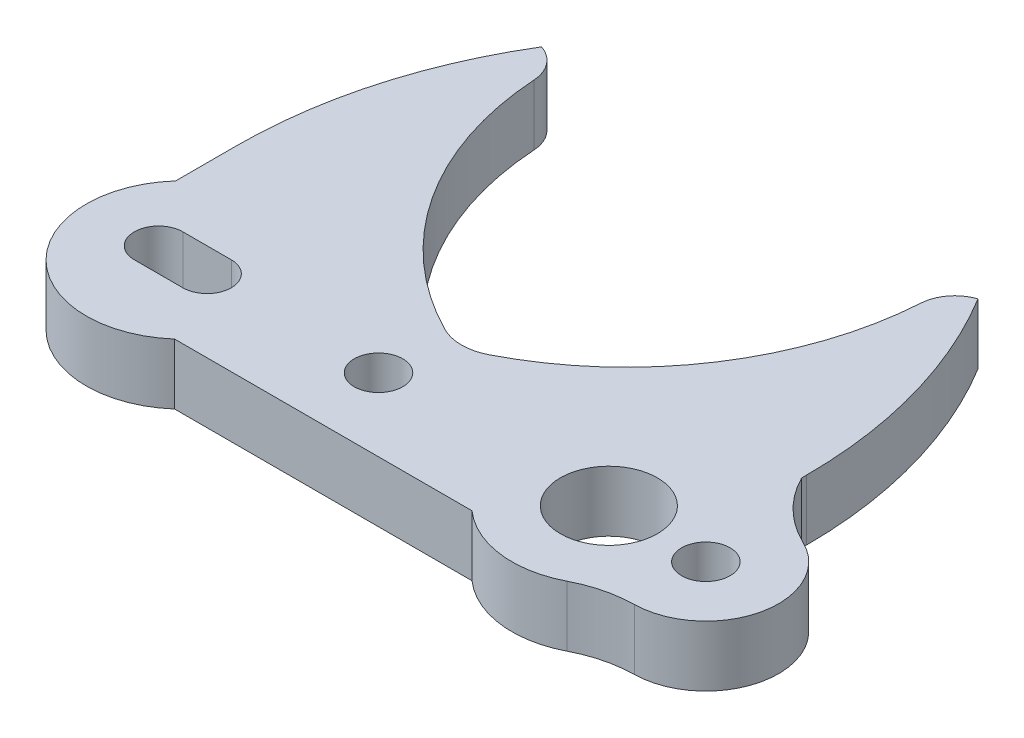
ISO-10303-21;
HEADER;
FILE_DESCRIPTION(('STEP AP214'),'2;1');
FILE_NAME('part.step','',(''),(''),'','','');
FILE_SCHEMA(('AUTOMOTIVE_DESIGN { 1 0 10303 214 1 1 1 1 }'));
ENDSEC;
DATA;
#1=APPLICATION_CONTEXT('core data for automotive mechanical design processes');
#2=APPLICATION_PROTOCOL_DEFINITION('international standard','automotive_design',2000,#1);
#3=PRODUCT_CONTEXT('',#1,'mechanical');
#4=PRODUCT('Part','Part','',(#3));
#5=PRODUCT_RELATED_PRODUCT_CATEGORY('part','',(#4));
#6=PRODUCT_DEFINITION_FORMATION('','',#4);
#7=PRODUCT_DEFINITION_CONTEXT('part definition',#1,'design');
#8=PRODUCT_DEFINITION('design','',#6,#7);
#9=PRODUCT_DEFINITION_SHAPE('','',#8);
#10=(LENGTH_UNIT() NAMED_UNIT(*) SI_UNIT(.MILLI.,.METRE.));
#11=(NAMED_UNIT(*) PLANE_ANGLE_UNIT() SI_UNIT($,.RADIAN.));
#12=(NAMED_UNIT(*) SI_UNIT($,.STERADIAN.) SOLID_ANGLE_UNIT());
#13=UNCERTAINTY_MEASURE_WITH_UNIT(LENGTH_MEASURE(1.E-05),#10,'distance_accuracy_value','');
#14=(GEOMETRIC_REPRESENTATION_CONTEXT(3) GLOBAL_UNCERTAINTY_ASSIGNED_CONTEXT((#13)) GLOBAL_UNIT_ASSIGNED_CONTEXT((#10,
#11,#12)) REPRESENTATION_CONTEXT('',''));
#15=CARTESIAN_POINT('',(0.,0.,0.));
#16=DIRECTION('',(0.,0.,1.));
#17=DIRECTION('',(1.,0.,0.));
#18=AXIS2_PLACEMENT_3D('',#15,#16,#17);
#19=CARTESIAN_POINT('',(32.4452024296811,5.,-18.3840550880154));
#20=DIRECTION('',(0.,-1.,0.));
#21=DIRECTION('',(0.,0.,-1.));
#22=AXIS2_PLACEMENT_3D('',#19,#20,#21);
#23=PLANE('',#22);
#24=CARTESIAN_POINT('',(-1.445,5.,-3.94365653125741));
#25=DIRECTION('',(0.,1.,0.));
#26=DIRECTION('',(0.,0.,1.));
#27=AXIS2_PLACEMENT_3D('',#24,#25,#26);
#28=CIRCLE('',#27,2.);
#29=CARTESIAN_POINT('',(-1.445,5.,-1.94365653125741));
#30=VERTEX_POINT('',#29);
#31=EDGE_CURVE('E206',#30,#30,#28,.T.);
#32=ORIENTED_EDGE('',*,*,#31,.F.);
#33=EDGE_LOOP('',(#32));
#34=FACE_BOUND('',#33,.T.);
#35=CARTESIAN_POINT('',(17.555,5.,-3.94365653125741));
#36=DIRECTION('',(0.,1.,0.));
#37=DIRECTION('',(0.,0.,1.));
#38=AXIS2_PLACEMENT_3D('',#35,#36,#37);
#39=CIRCLE('',#38,4.);
#40=CARTESIAN_POINT('',(17.555,5.,0.0563434687425894));
#41=VERTEX_POINT('',#40);
#42=EDGE_CURVE('E212',#41,#41,#39,.T.);
#43=ORIENTED_EDGE('',*,*,#42,.F.);
#44=EDGE_LOOP('',(#43));
#45=FACE_BOUND('',#44,.T.);
#46=CARTESIAN_POINT('',(-14.2977037553402,5.,-14.2803935708244));
#47=DIRECTION('',(0.,1.,0.));
#48=DIRECTION('',(0.,0.,1.));
#49=AXIS2_PLACEMENT_3D('',#46,#47,#48);
#50=CIRCLE('',#49,37.8125055784307);
#51=CARTESIAN_POINT('',(23.5148018230905,5.,-14.2803935708245));
#52=VERTEX_POINT('',#51);
#53=CARTESIAN_POINT('',(18.,5.,-33.9436565312574));
#54=VERTEX_POINT('',#53);
#55=EDGE_CURVE('E224',#52,#54,#50,.T.);
#56=ORIENTED_EDGE('',*,*,#55,.T.);
#57=CARTESIAN_POINT('',(18.9410211603675,5.,-31.0950640409667));
#58=DIRECTION('',(0.,-1.,0.));
#59=DIRECTION('',(0.,0.,-1.));
#60=AXIS2_PLACEMENT_3D('',#57,#58,#59);
#61=CIRCLE('',#60,3.);
#62=CARTESIAN_POINT('',(15.9471224196398,5.,-31.2862977468588));
#63=VERTEX_POINT('',#62);
#64=EDGE_CURVE('E11',#54,#63,#61,.F.);
#65=ORIENTED_EDGE('',*,*,#64,.T.);
#66=CARTESIAN_POINT('',(-10.,5.,-32.9436565312574));
#67=DIRECTION('',(0.,-1.,0.));
#68=DIRECTION('',(0.,0.,-1.));
#69=AXIS2_PLACEMENT_3D('',#66,#67,#68);
#70=CIRCLE('',#69,26.);
#71=CARTESIAN_POINT('',(1.81818181818182,5.,-9.784844417671));
#72=VERTEX_POINT('',#71);
#73=EDGE_CURVE('E226',#63,#72,#70,.T.);
#74=ORIENTED_EDGE('',*,*,#73,.T.);
#75=CARTESIAN_POINT('',(0.,5.,-13.347738588992));
#76=DIRECTION('',(0.,-1.,0.));
#77=DIRECTION('',(0.,0.,-1.));
#78=AXIS2_PLACEMENT_3D('',#75,#76,#77);
#79=CIRCLE('',#78,4.);
#80=CARTESIAN_POINT('',(-1.81818181818182,5.,-9.784844417671));
#81=VERTEX_POINT('',#80);
#82=EDGE_CURVE('E311',#72,#81,#79,.T.);
#83=ORIENTED_EDGE('',*,*,#82,.T.);
#84=CARTESIAN_POINT('',(10.,5.,-32.9436565312574));
#85=DIRECTION('',(0.,-1.,0.));
#86=DIRECTION('',(0.,0.,1.));
#87=AXIS2_PLACEMENT_3D('',#84,#85,#86);
#88=CIRCLE('',#87,26.);
#89=CARTESIAN_POINT('',(-15.9471224196398,5.,-31.2862977468588));
#90=VERTEX_POINT('',#89);
#91=EDGE_CURVE('E228',#81,#90,#88,.T.);
#92=ORIENTED_EDGE('',*,*,#91,.T.);
#93=CARTESIAN_POINT('',(-18.9410211603675,5.,-31.0950640409667));
#94=DIRECTION('',(0.,-1.,0.));
#95=DIRECTION('',(0.,0.,-1.));
#96=AXIS2_PLACEMENT_3D('',#93,#94,#95);
#97=CIRCLE('',#96,3.);
#98=CARTESIAN_POINT('',(-18.,5.,-33.9436565312574));
#99=VERTEX_POINT('',#98);
#100=EDGE_CURVE('E317',#90,#99,#97,.F.);
#101=ORIENTED_EDGE('',*,*,#100,.T.);
#102=CARTESIAN_POINT('',(14.2977037553402,5.,-14.2803935708244));
#103=DIRECTION('',(0.,1.,0.));
#104=DIRECTION('',(0.,0.,-1.));
#105=AXIS2_PLACEMENT_3D('',#102,#103,#104);
#106=CIRCLE('',#105,37.8125055784307);
#107=CARTESIAN_POINT('',(-23.5148018230905,5.,-14.2803935708245));
#108=VERTEX_POINT('',#107);
#109=EDGE_CURVE('E231',#99,#108,#106,.T.);
#110=ORIENTED_EDGE('',*,*,#109,.T.);
#111=DIRECTION('',(0.,0.,1.));
#112=VECTOR('',#111,1.);
#113=CARTESIAN_POINT('',(-23.5148018230905,5.,-9.28039357082448));
#114=LINE('',#113,#112);
#115=CARTESIAN_POINT('',(-23.5148018230905,5.,-9.28039357082448));
#116=VERTEX_POINT('',#115);
#117=EDGE_CURVE('E233',#108,#116,#114,.T.);
#118=ORIENTED_EDGE('',*,*,#117,.T.);
#119=CARTESIAN_POINT('',(-17.555,5.,-3.94365653125742));
#120=DIRECTION('',(0.,1.,0.));
#121=DIRECTION('',(0.,0.,-1.));
#122=AXIS2_PLACEMENT_3D('',#119,#120,#121);
#123=CIRCLE('',#122,8.);
#124=CARTESIAN_POINT('',(-12.2634973778708,5.,2.05634346874259));
#125=VERTEX_POINT('',#124);
#126=EDGE_CURVE('E235',#116,#125,#123,.T.);
#127=ORIENTED_EDGE('',*,*,#126,.T.);
#128=DIRECTION('',(1.,0.,0.));
#129=VECTOR('',#128,1.);
#130=CARTESIAN_POINT('',(-12.2634973778708,5.,2.05634346874259));
#131=LINE('',#130,#129);
#132=CARTESIAN_POINT('',(12.2634973778708,5.,2.05634346874259));
#133=VERTEX_POINT('',#132);
#134=EDGE_CURVE('E237',#125,#133,#131,.T.);
#135=ORIENTED_EDGE('',*,*,#134,.T.);
#136=CARTESIAN_POINT('',(17.555,5.,-3.94365653125741));
#137=DIRECTION('',(0.,1.,0.));
#138=DIRECTION('',(0.,0.,1.));
#139=AXIS2_PLACEMENT_3D('',#136,#137,#138);
#140=CIRCLE('',#139,8.);
#141=CARTESIAN_POINT('',(21.2216666666666,5.,3.16658647130977));
#142=VERTEX_POINT('',#141);
#143=EDGE_CURVE('E239',#133,#142,#140,.T.);
#144=ORIENTED_EDGE('',*,*,#143,.T.);
#145=CARTESIAN_POINT('',(25.805,5.,12.0543902245188));
#146=DIRECTION('',(0.,-1.,0.));
#147=DIRECTION('',(0.,0.,1.));
#148=AXIS2_PLACEMENT_3D('',#145,#146,#147);
#149=CIRCLE('',#148,10.);
#150=CARTESIAN_POINT('',(25.64875,5.,2.05561100215867));
#151=VERTEX_POINT('',#150);
#152=EDGE_CURVE('E241',#142,#151,#149,.T.);
#153=ORIENTED_EDGE('',*,*,#152,.T.);
#154=CARTESIAN_POINT('',(25.555,5.,-3.94365653125741));
#155=DIRECTION('',(0.,1.,0.));
#156=DIRECTION('',(0.,0.,1.));
#157=AXIS2_PLACEMENT_3D('',#154,#155,#156);
#158=CIRCLE('',#157,6.00000000000002);
#159=CARTESIAN_POINT('',(28.1388259111304,5.,-9.35880599004165));
#160=VERTEX_POINT('',#159);
#161=EDGE_CURVE('E243',#151,#160,#158,.T.);
#162=ORIENTED_EDGE('',*,*,#161,.T.);
#163=CARTESIAN_POINT('',(32.4452024296811,5.,-18.3840550880154));
#164=DIRECTION('',(0.,-1.,0.));
#165=DIRECTION('',(0.,0.,-1.));
#166=AXIS2_PLACEMENT_3D('',#163,#164,#165);
#167=CIRCLE('',#166,10.);
#168=CARTESIAN_POINT('',(23.5148018230905,5.,-13.8842834264968));
#169=VERTEX_POINT('',#168);
#170=EDGE_CURVE('E218',#160,#169,#167,.T.);
#171=ORIENTED_EDGE('',*,*,#170,.T.);
#172=DIRECTION('',(0.,0.,-1.));
#173=VECTOR('',#172,1.);
#174=CARTESIAN_POINT('',(23.5148018230905,5.,-13.8842834264968));
#175=LINE('',#174,#173);
#176=EDGE_CURVE('E221',#169,#52,#175,.T.);
#177=ORIENTED_EDGE('',*,*,#176,.T.);
#178=EDGE_LOOP('',(#56,#65,#74,#83,#92,#101,#110,#118,#127,#135,#144,#153,#162,#171,#177));
#179=FACE_BOUND('',#178,.T.);
#180=CARTESIAN_POINT('',(-19.585,5.,-3.94365653125741));
#181=DIRECTION('',(0.,1.,0.));
#182=DIRECTION('',(0.,0.,1.));
#183=AXIS2_PLACEMENT_3D('',#180,#181,#182);
#184=CIRCLE('',#183,2.);
#185=CARTESIAN_POINT('',(-19.585,5.,-5.94365653125741));
#186=VERTEX_POINT('',#185);
#187=CARTESIAN_POINT('',(-19.585,5.,-1.94365653125741));
#188=VERTEX_POINT('',#187);
#189=EDGE_CURVE('E162',#186,#188,#184,.T.);
#190=ORIENTED_EDGE('',*,*,#189,.F.);
#191=DIRECTION('',(-1.,0.,0.));
#192=VECTOR('',#191,1.);
#193=CARTESIAN_POINT('',(-19.585,5.,-5.94365653125741));
#194=LINE('',#193,#192);
#195=CARTESIAN_POINT('',(-15.585,5.,-5.94365653125741));
#196=VERTEX_POINT('',#195);
#197=EDGE_CURVE('E188',#196,#186,#194,.T.);
#198=ORIENTED_EDGE('',*,*,#197,.F.);
#199=CARTESIAN_POINT('',(-15.585,5.,-3.94365653125741));
#200=DIRECTION('',(0.,1.,0.));
#201=DIRECTION('',(0.,0.,1.));
#202=AXIS2_PLACEMENT_3D('',#199,#200,#201);
#203=CIRCLE('',#202,2.);
#204=CARTESIAN_POINT('',(-15.585,5.,-1.94365653125741));
#205=VERTEX_POINT('',#204);
#206=EDGE_CURVE('E186',#205,#196,#203,.T.);
#207=ORIENTED_EDGE('',*,*,#206,.F.);
#208=DIRECTION('',(1.,0.,0.));
#209=VECTOR('',#208,1.);
#210=CARTESIAN_POINT('',(-19.585,5.,-1.94365653125741));
#211=LINE('',#210,#209);
#212=EDGE_CURVE('E172',#188,#205,#211,.T.);
#213=ORIENTED_EDGE('',*,*,#212,.F.);
#214=EDGE_LOOP('',(#190,#198,#207,#213));
#215=FACE_BOUND('',#214,.T.);
#216=CARTESIAN_POINT('',(25.555,5.,-3.94365653125741));
#217=DIRECTION('',(0.,1.,0.));
#218=DIRECTION('',(0.,0.,1.));
#219=AXIS2_PLACEMENT_3D('',#216,#217,#218);
#220=CIRCLE('',#219,2.);
#221=CARTESIAN_POINT('',(25.555,5.,-1.94365653125741));
#222=VERTEX_POINT('',#221);
#223=EDGE_CURVE('E195',#222,#222,#220,.T.);
#224=ORIENTED_EDGE('',*,*,#223,.F.);
#225=EDGE_LOOP('',(#224));
#226=FACE_BOUND('',#225,.T.);
#227=ADVANCED_FACE('F32',(#34,#45,#179,#215,#226),#23,.F.);
#228=CARTESIAN_POINT('',(32.4452024296811,0.,-18.3840550880154));
#229=DIRECTION('',(0.,-1.,0.));
#230=DIRECTION('',(0.,0.,-1.));
#231=AXIS2_PLACEMENT_3D('',#228,#229,#230);
#232=PLANE('',#231);
#233=DIRECTION('',(-1.,0.,0.));
#234=VECTOR('',#233,1.);
#235=CARTESIAN_POINT('',(-19.585,0.,-5.94365653125741));
#236=LINE('',#235,#234);
#237=CARTESIAN_POINT('',(-15.585,0.,-5.94365653125741));
#238=VERTEX_POINT('',#237);
#239=CARTESIAN_POINT('',(-19.585,0.,-5.94365653125741));
#240=VERTEX_POINT('',#239);
#241=EDGE_CURVE('E173',#238,#240,#236,.T.);
#242=ORIENTED_EDGE('',*,*,#241,.T.);
#243=CARTESIAN_POINT('',(-19.585,0.,-3.94365653125741));
#244=DIRECTION('',(0.,1.,0.));
#245=DIRECTION('',(0.,0.,1.));
#246=AXIS2_PLACEMENT_3D('',#243,#244,#245);
#247=CIRCLE('',#246,2.);
#248=CARTESIAN_POINT('',(-19.585,0.,-1.94365653125741));
#249=VERTEX_POINT('',#248);
#250=EDGE_CURVE('E193',#240,#249,#247,.T.);
#251=ORIENTED_EDGE('',*,*,#250,.T.);
#252=DIRECTION('',(1.,0.,0.));
#253=VECTOR('',#252,1.);
#254=CARTESIAN_POINT('',(-19.585,0.,-1.94365653125741));
#255=LINE('',#254,#253);
#256=CARTESIAN_POINT('',(-15.585,0.,-1.94365653125741));
#257=VERTEX_POINT('',#256);
#258=EDGE_CURVE('E179',#249,#257,#255,.T.);
#259=ORIENTED_EDGE('',*,*,#258,.T.);
#260=CARTESIAN_POINT('',(-15.585,0.,-3.94365653125741));
#261=DIRECTION('',(0.,1.,0.));
#262=DIRECTION('',(0.,0.,1.));
#263=AXIS2_PLACEMENT_3D('',#260,#261,#262);
#264=CIRCLE('',#263,2.);
#265=EDGE_CURVE('E197',#257,#238,#264,.T.);
#266=ORIENTED_EDGE('',*,*,#265,.T.);
#267=EDGE_LOOP('',(#242,#251,#259,#266));
#268=FACE_BOUND('',#267,.T.);
#269=CARTESIAN_POINT('',(-1.445,0.,-3.94365653125741));
#270=DIRECTION('',(0.,1.,0.));
#271=DIRECTION('',(0.,0.,1.));
#272=AXIS2_PLACEMENT_3D('',#269,#270,#271);
#273=CIRCLE('',#272,2.);
#274=CARTESIAN_POINT('',(-1.445,0.,-1.94365653125741));
#275=VERTEX_POINT('',#274);
#276=EDGE_CURVE('E180',#275,#275,#273,.T.);
#277=ORIENTED_EDGE('',*,*,#276,.T.);
#278=EDGE_LOOP('',(#277));
#279=FACE_BOUND('',#278,.T.);
#280=CARTESIAN_POINT('',(-10.,0.,-32.9436565312574));
#281=DIRECTION('',(0.,-1.,0.));
#282=DIRECTION('',(0.,0.,-1.));
#283=AXIS2_PLACEMENT_3D('',#280,#281,#282);
#284=CIRCLE('',#283,26.);
#285=CARTESIAN_POINT('',(15.9471224196398,0.,-31.2862977468588));
#286=VERTEX_POINT('',#285);
#287=CARTESIAN_POINT('',(1.81818181818182,0.,-9.784844417671));
#288=VERTEX_POINT('',#287);
#289=EDGE_CURVE('E253',#286,#288,#284,.T.);
#290=ORIENTED_EDGE('',*,*,#289,.F.);
#291=CARTESIAN_POINT('',(18.9410211603675,0.,-31.0950640409667));
#292=DIRECTION('',(0.,-1.,0.));
#293=DIRECTION('',(0.,0.,-1.));
#294=AXIS2_PLACEMENT_3D('',#291,#292,#293);
#295=CIRCLE('',#294,3.);
#296=CARTESIAN_POINT('',(18.,0.,-33.9436565312574));
#297=VERTEX_POINT('',#296);
#298=EDGE_CURVE('E40',#286,#297,#295,.T.);
#299=ORIENTED_EDGE('',*,*,#298,.T.);
#300=CARTESIAN_POINT('',(-14.2977037553402,0.,-14.2803935708244));
#301=DIRECTION('',(0.,1.,0.));
#302=DIRECTION('',(0.,0.,1.));
#303=AXIS2_PLACEMENT_3D('',#300,#301,#302);
#304=CIRCLE('',#303,37.8125055784307);
#305=CARTESIAN_POINT('',(23.5148018230905,0.,-14.2803935708245));
#306=VERTEX_POINT('',#305);
#307=EDGE_CURVE('E250',#306,#297,#304,.T.);
#308=ORIENTED_EDGE('',*,*,#307,.F.);
#309=DIRECTION('',(0.,0.,-1.));
#310=VECTOR('',#309,1.);
#311=CARTESIAN_POINT('',(23.5148018230905,0.,-13.8842834264968));
#312=LINE('',#311,#310);
#313=CARTESIAN_POINT('',(23.5148018230905,0.,-13.8842834264968));
#314=VERTEX_POINT('',#313);
#315=EDGE_CURVE('E248',#314,#306,#312,.T.);
#316=ORIENTED_EDGE('',*,*,#315,.F.);
#317=CARTESIAN_POINT('',(32.4452024296811,0.,-18.3840550880154));
#318=DIRECTION('',(0.,-1.,0.));
#319=DIRECTION('',(0.,0.,-1.));
#320=AXIS2_PLACEMENT_3D('',#317,#318,#319);
#321=CIRCLE('',#320,10.);
#322=CARTESIAN_POINT('',(28.1388259111304,0.,-9.35880599004165));
#323=VERTEX_POINT('',#322);
#324=EDGE_CURVE('E215',#323,#314,#321,.T.);
#325=ORIENTED_EDGE('',*,*,#324,.F.);
#326=CARTESIAN_POINT('',(25.555,0.,-3.94365653125741));
#327=DIRECTION('',(0.,1.,0.));
#328=DIRECTION('',(0.,0.,1.));
#329=AXIS2_PLACEMENT_3D('',#326,#327,#328);
#330=CIRCLE('',#329,6.00000000000002);
#331=CARTESIAN_POINT('',(25.64875,0.,2.05561100215867));
#332=VERTEX_POINT('',#331);
#333=EDGE_CURVE('E222',#332,#323,#330,.T.);
#334=ORIENTED_EDGE('',*,*,#333,.F.);
#335=CARTESIAN_POINT('',(25.805,0.,12.0543902245188));
#336=DIRECTION('',(0.,-1.,0.));
#337=DIRECTION('',(0.,0.,1.));
#338=AXIS2_PLACEMENT_3D('',#335,#336,#337);
#339=CIRCLE('',#338,10.);
#340=CARTESIAN_POINT('',(21.2216666666666,0.,3.16658647130977));
#341=VERTEX_POINT('',#340);
#342=EDGE_CURVE('E268',#341,#332,#339,.T.);
#343=ORIENTED_EDGE('',*,*,#342,.F.);
#344=CARTESIAN_POINT('',(17.555,0.,-3.94365653125741));
#345=DIRECTION('',(0.,1.,0.));
#346=DIRECTION('',(0.,0.,1.));
#347=AXIS2_PLACEMENT_3D('',#344,#345,#346);
#348=CIRCLE('',#347,8.);
#349=CARTESIAN_POINT('',(12.2634973778708,0.,2.05634346874259));
#350=VERTEX_POINT('',#349);
#351=EDGE_CURVE('E266',#350,#341,#348,.T.);
#352=ORIENTED_EDGE('',*,*,#351,.F.);
#353=DIRECTION('',(1.,0.,0.));
#354=VECTOR('',#353,1.);
#355=CARTESIAN_POINT('',(-12.2634973778708,0.,2.05634346874259));
#356=LINE('',#355,#354);
#357=CARTESIAN_POINT('',(-12.2634973778708,0.,2.05634346874259));
#358=VERTEX_POINT('',#357);
#359=EDGE_CURVE('E264',#358,#350,#356,.T.);
#360=ORIENTED_EDGE('',*,*,#359,.F.);
#361=CARTESIAN_POINT('',(-17.555,0.,-3.94365653125742));
#362=DIRECTION('',(0.,1.,0.));
#363=DIRECTION('',(0.,0.,-1.));
#364=AXIS2_PLACEMENT_3D('',#361,#362,#363);
#365=CIRCLE('',#364,8.);
#366=CARTESIAN_POINT('',(-23.5148018230905,0.,-9.28039357082448));
#367=VERTEX_POINT('',#366);
#368=EDGE_CURVE('E262',#367,#358,#365,.T.);
#369=ORIENTED_EDGE('',*,*,#368,.F.);
#370=DIRECTION('',(0.,0.,1.));
#371=VECTOR('',#370,1.);
#372=CARTESIAN_POINT('',(-23.5148018230905,0.,-9.28039357082448));
#373=LINE('',#372,#371);
#374=CARTESIAN_POINT('',(-23.5148018230905,0.,-14.2803935708245));
#375=VERTEX_POINT('',#374);
#376=EDGE_CURVE('E260',#375,#367,#373,.T.);
#377=ORIENTED_EDGE('',*,*,#376,.F.);
#378=CARTESIAN_POINT('',(14.2977037553402,0.,-14.2803935708244));
#379=DIRECTION('',(0.,1.,0.));
#380=DIRECTION('',(0.,0.,-1.));
#381=AXIS2_PLACEMENT_3D('',#378,#379,#380);
#382=CIRCLE('',#381,37.8125055784307);
#383=CARTESIAN_POINT('',(-18.,0.,-33.9436565312574));
#384=VERTEX_POINT('',#383);
#385=EDGE_CURVE('E258',#384,#375,#382,.T.);
#386=ORIENTED_EDGE('',*,*,#385,.F.);
#387=CARTESIAN_POINT('',(-18.9410211603675,0.,-31.0950640409667));
#388=DIRECTION('',(0.,-1.,0.));
#389=DIRECTION('',(0.,0.,-1.));
#390=AXIS2_PLACEMENT_3D('',#387,#388,#389);
#391=CIRCLE('',#390,3.);
#392=CARTESIAN_POINT('',(-15.9471224196398,0.,-31.2862977468588));
#393=VERTEX_POINT('',#392);
#394=EDGE_CURVE('E313',#384,#393,#391,.T.);
#395=ORIENTED_EDGE('',*,*,#394,.T.);
#396=CARTESIAN_POINT('',(10.,0.,-32.9436565312574));
#397=DIRECTION('',(0.,-1.,0.));
#398=DIRECTION('',(0.,0.,1.));
#399=AXIS2_PLACEMENT_3D('',#396,#397,#398);
#400=CIRCLE('',#399,26.);
#401=CARTESIAN_POINT('',(-1.81818181818182,0.,-9.784844417671));
#402=VERTEX_POINT('',#401);
#403=EDGE_CURVE('E255',#402,#393,#400,.T.);
#404=ORIENTED_EDGE('',*,*,#403,.F.);
#405=CARTESIAN_POINT('',(0.,0.,-13.347738588992));
#406=DIRECTION('',(0.,-1.,0.));
#407=DIRECTION('',(0.,0.,-1.));
#408=AXIS2_PLACEMENT_3D('',#405,#406,#407);
#409=CIRCLE('',#408,4.);
#410=EDGE_CURVE('E308',#402,#288,#409,.F.);
#411=ORIENTED_EDGE('',*,*,#410,.T.);
#412=EDGE_LOOP('',(#290,#299,#308,#316,#325,#334,#343,#352,#360,#369,#377,#386,#395,#404,#411));
#413=FACE_BOUND('',#412,.T.);
#414=CARTESIAN_POINT('',(17.555,0.,-3.94365653125741));
#415=DIRECTION('',(0.,1.,0.));
#416=DIRECTION('',(0.,0.,1.));
#417=AXIS2_PLACEMENT_3D('',#414,#415,#416);
#418=CIRCLE('',#417,4.);
#419=CARTESIAN_POINT('',(17.555,0.,0.0563434687425894));
#420=VERTEX_POINT('',#419);
#421=EDGE_CURVE('E209',#420,#420,#418,.T.);
#422=ORIENTED_EDGE('',*,*,#421,.T.);
#423=EDGE_LOOP('',(#422));
#424=FACE_BOUND('',#423,.T.);
#425=CARTESIAN_POINT('',(25.555,0.,-3.94365653125741));
#426=DIRECTION('',(0.,1.,0.));
#427=DIRECTION('',(0.,0.,1.));
#428=AXIS2_PLACEMENT_3D('',#425,#426,#427);
#429=CIRCLE('',#428,2.);
#430=CARTESIAN_POINT('',(25.555,0.,-1.94365653125741));
#431=VERTEX_POINT('',#430);
#432=EDGE_CURVE('E597',#431,#431,#429,.T.);
#433=ORIENTED_EDGE('',*,*,#432,.T.);
#434=EDGE_LOOP('',(#433));
#435=FACE_BOUND('',#434,.T.);
#436=ADVANCED_FACE('F323',(#268,#279,#413,#424,#435),#232,.T.);
#437=CARTESIAN_POINT('',(32.4452024296811,5.,-18.3840550880154));
#438=DIRECTION('',(0.,-1.,0.));
#439=DIRECTION('',(0.,0.,-1.));
#440=AXIS2_PLACEMENT_3D('',#437,#438,#439);
#441=CYLINDRICAL_SURFACE('',#440,10.);
#442=ORIENTED_EDGE('',*,*,#324,.T.);
#443=DIRECTION('',(0.,-1.,0.));
#444=VECTOR('',#443,1.);
#445=CARTESIAN_POINT('',(23.5148018230905,5.,-13.8842834264968));
#446=LINE('',#445,#444);
#447=EDGE_CURVE('E299',#169,#314,#446,.T.);
#448=ORIENTED_EDGE('',*,*,#447,.F.);
#449=ORIENTED_EDGE('',*,*,#170,.F.);
#450=DIRECTION('',(0.,-1.,0.));
#451=VECTOR('',#450,1.);
#452=CARTESIAN_POINT('',(28.1388259111304,5.,-9.35880599004165));
#453=LINE('',#452,#451);
#454=EDGE_CURVE('E245',#160,#323,#453,.T.);
#455=ORIENTED_EDGE('',*,*,#454,.T.);
#456=EDGE_LOOP('',(#442,#448,#449,#455));
#457=FACE_BOUND('',#456,.T.);
#458=ADVANCED_FACE('F385',(#457),#441,.F.);
#459=CARTESIAN_POINT('',(23.5148018230905,5.,-13.8842834264968));
#460=DIRECTION('',(-1.,0.,0.));
#461=DIRECTION('',(0.,0.,1.));
#462=AXIS2_PLACEMENT_3D('',#459,#460,#461);
#463=PLANE('',#462);
#464=ORIENTED_EDGE('',*,*,#315,.T.);
#465=DIRECTION('',(0.,-1.,0.));
#466=VECTOR('',#465,1.);
#467=CARTESIAN_POINT('',(23.5148018230905,5.,-14.2803935708245));
#468=LINE('',#467,#466);
#469=EDGE_CURVE('E296',#52,#306,#468,.T.);
#470=ORIENTED_EDGE('',*,*,#469,.F.);
#471=ORIENTED_EDGE('',*,*,#176,.F.);
#472=ORIENTED_EDGE('',*,*,#447,.T.);
#473=EDGE_LOOP('',(#464,#470,#471,#472));
#474=FACE_BOUND('',#473,.T.);
#475=ADVANCED_FACE('F387',(#474),#463,.F.);
#476=CARTESIAN_POINT('',(-14.2977037553402,5.,-14.2803935708244));
#477=DIRECTION('',(0.,-1.,0.));
#478=DIRECTION('',(0.,0.,-1.));
#479=AXIS2_PLACEMENT_3D('',#476,#477,#478);
#480=CYLINDRICAL_SURFACE('',#479,37.8125055784307);
#481=ORIENTED_EDGE('',*,*,#307,.T.);
#482=DIRECTION('',(0.,-1.,0.));
#483=VECTOR('',#482,1.);
#484=CARTESIAN_POINT('',(18.,5.,-33.9436565312574));
#485=LINE('',#484,#483);
#486=EDGE_CURVE('E294',#54,#297,#485,.T.);
#487=ORIENTED_EDGE('',*,*,#486,.F.);
#488=ORIENTED_EDGE('',*,*,#55,.F.);
#489=ORIENTED_EDGE('',*,*,#469,.T.);
#490=EDGE_LOOP('',(#481,#487,#488,#489));
#491=FACE_BOUND('',#490,.T.);
#492=ADVANCED_FACE('F327',(#491),#480,.T.);
#493=CARTESIAN_POINT('',(-10.,5.,-32.9436565312574));
#494=DIRECTION('',(0.,-1.,0.));
#495=DIRECTION('',(0.,0.,-1.));
#496=AXIS2_PLACEMENT_3D('',#493,#494,#495);
#497=CYLINDRICAL_SURFACE('',#496,26.);
#498=ORIENTED_EDGE('',*,*,#73,.F.);
#499=DIRECTION('',(0.,-1.,0.));
#500=VECTOR('',#499,1.);
#501=CARTESIAN_POINT('',(15.9471224196398,5.,-31.2862977468588));
#502=LINE('',#501,#500);
#503=EDGE_CURVE('E319',#63,#286,#502,.T.);
#504=ORIENTED_EDGE('',*,*,#503,.T.);
#505=ORIENTED_EDGE('',*,*,#289,.T.);
#506=DIRECTION('',(0.,-1.,0.));
#507=VECTOR('',#506,1.);
#508=CARTESIAN_POINT('',(1.81818181818182,5.,-9.784844417671));
#509=LINE('',#508,#507);
#510=EDGE_CURVE('E305',#288,#72,#509,.F.);
#511=ORIENTED_EDGE('',*,*,#510,.T.);
#512=EDGE_LOOP('',(#498,#504,#505,#511));
#513=FACE_BOUND('',#512,.T.);
#514=ADVANCED_FACE('F331',(#513),#497,.F.);
#515=CARTESIAN_POINT('',(10.,5.,-32.9436565312574));
#516=DIRECTION('',(0.,-1.,0.));
#517=DIRECTION('',(0.,0.,-1.));
#518=AXIS2_PLACEMENT_3D('',#515,#516,#517);
#519=CYLINDRICAL_SURFACE('',#518,26.);
#520=ORIENTED_EDGE('',*,*,#403,.T.);
#521=DIRECTION('',(0.,-1.,0.));
#522=VECTOR('',#521,1.);
#523=CARTESIAN_POINT('',(-15.9471224196398,5.,-31.2862977468588));
#524=LINE('',#523,#522);
#525=EDGE_CURVE('E315',#393,#90,#524,.F.);
#526=ORIENTED_EDGE('',*,*,#525,.T.);
#527=ORIENTED_EDGE('',*,*,#91,.F.);
#528=DIRECTION('',(0.,-1.,0.));
#529=VECTOR('',#528,1.);
#530=CARTESIAN_POINT('',(-1.81818181818182,5.,-9.784844417671));
#531=LINE('',#530,#529);
#532=EDGE_CURVE('E302',#81,#402,#531,.T.);
#533=ORIENTED_EDGE('',*,*,#532,.T.);
#534=EDGE_LOOP('',(#520,#526,#527,#533));
#535=FACE_BOUND('',#534,.T.);
#536=ADVANCED_FACE('F339',(#535),#519,.F.);
#537=CARTESIAN_POINT('',(14.2977037553402,5.,-14.2803935708244));
#538=DIRECTION('',(0.,-1.,0.));
#539=DIRECTION('',(0.,0.,-1.));
#540=AXIS2_PLACEMENT_3D('',#537,#538,#539);
#541=CYLINDRICAL_SURFACE('',#540,37.8125055784307);
#542=ORIENTED_EDGE('',*,*,#385,.T.);
#543=DIRECTION('',(0.,-1.,0.));
#544=VECTOR('',#543,1.);
#545=CARTESIAN_POINT('',(-23.5148018230905,5.,-14.2803935708245));
#546=LINE('',#545,#544);
#547=EDGE_CURVE('E288',#108,#375,#546,.T.);
#548=ORIENTED_EDGE('',*,*,#547,.F.);
#549=ORIENTED_EDGE('',*,*,#109,.F.);
#550=DIRECTION('',(0.,-1.,0.));
#551=VECTOR('',#550,1.);
#552=CARTESIAN_POINT('',(-18.,5.,-33.9436565312574));
#553=LINE('',#552,#551);
#554=EDGE_CURVE('E291',#99,#384,#553,.T.);
#555=ORIENTED_EDGE('',*,*,#554,.T.);
#556=EDGE_LOOP('',(#542,#548,#549,#555));
#557=FACE_BOUND('',#556,.T.);
#558=ADVANCED_FACE('F350',(#557),#541,.T.);
#559=CARTESIAN_POINT('',(-23.5148018230905,5.,-9.28039357082448));
#560=DIRECTION('',(1.,0.,0.));
#561=DIRECTION('',(0.,0.,-1.));
#562=AXIS2_PLACEMENT_3D('',#559,#560,#561);
#563=PLANE('',#562);
#564=ORIENTED_EDGE('',*,*,#376,.T.);
#565=DIRECTION('',(0.,-1.,0.));
#566=VECTOR('',#565,1.);
#567=CARTESIAN_POINT('',(-23.5148018230905,5.,-9.28039357082448));
#568=LINE('',#567,#566);
#569=EDGE_CURVE('E285',#116,#367,#568,.T.);
#570=ORIENTED_EDGE('',*,*,#569,.F.);
#571=ORIENTED_EDGE('',*,*,#117,.F.);
#572=ORIENTED_EDGE('',*,*,#547,.T.);
#573=EDGE_LOOP('',(#564,#570,#571,#572));
#574=FACE_BOUND('',#573,.T.);
#575=ADVANCED_FACE('F355',(#574),#563,.F.);
#576=CARTESIAN_POINT('',(-17.555,5.,-3.94365653125742));
#577=DIRECTION('',(0.,-1.,0.));
#578=DIRECTION('',(0.,0.,-1.));
#579=AXIS2_PLACEMENT_3D('',#576,#577,#578);
#580=CYLINDRICAL_SURFACE('',#579,8.);
#581=ORIENTED_EDGE('',*,*,#368,.T.);
#582=DIRECTION('',(0.,-1.,0.));
#583=VECTOR('',#582,1.);
#584=CARTESIAN_POINT('',(-12.2634973778708,5.,2.05634346874259));
#585=LINE('',#584,#583);
#586=EDGE_CURVE('E282',#125,#358,#585,.T.);
#587=ORIENTED_EDGE('',*,*,#586,.F.);
#588=ORIENTED_EDGE('',*,*,#126,.F.);
#589=ORIENTED_EDGE('',*,*,#569,.T.);
#590=EDGE_LOOP('',(#581,#587,#588,#589));
#591=FACE_BOUND('',#590,.T.);
#592=ADVANCED_FACE('F361',(#591),#580,.T.);
#593=CARTESIAN_POINT('',(-12.2634973778708,5.,2.05634346874259));
#594=DIRECTION('',(0.,0.,-1.));
#595=DIRECTION('',(-1.,0.,0.));
#596=AXIS2_PLACEMENT_3D('',#593,#594,#595);
#597=PLANE('',#596);
#598=ORIENTED_EDGE('',*,*,#359,.T.);
#599=DIRECTION('',(0.,-1.,0.));
#600=VECTOR('',#599,1.);
#601=CARTESIAN_POINT('',(12.2634973778708,5.,2.05634346874259));
#602=LINE('',#601,#600);
#603=EDGE_CURVE('E279',#133,#350,#602,.T.);
#604=ORIENTED_EDGE('',*,*,#603,.F.);
#605=ORIENTED_EDGE('',*,*,#134,.F.);
#606=ORIENTED_EDGE('',*,*,#586,.T.);
#607=EDGE_LOOP('',(#598,#604,#605,#606));
#608=FACE_BOUND('',#607,.T.);
#609=ADVANCED_FACE('F365',(#608),#597,.F.);
#610=CARTESIAN_POINT('',(17.555,5.,-3.94365653125741));
#611=DIRECTION('',(0.,-1.,0.));
#612=DIRECTION('',(0.,0.,-1.));
#613=AXIS2_PLACEMENT_3D('',#610,#611,#612);
#614=CYLINDRICAL_SURFACE('',#613,8.);
#615=ORIENTED_EDGE('',*,*,#351,.T.);
#616=DIRECTION('',(0.,-1.,0.));
#617=VECTOR('',#616,1.);
#618=CARTESIAN_POINT('',(21.2216666666666,5.,3.16658647130977));
#619=LINE('',#618,#617);
#620=EDGE_CURVE('E276',#142,#341,#619,.T.);
#621=ORIENTED_EDGE('',*,*,#620,.F.);
#622=ORIENTED_EDGE('',*,*,#143,.F.);
#623=ORIENTED_EDGE('',*,*,#603,.T.);
#624=EDGE_LOOP('',(#615,#621,#622,#623));
#625=FACE_BOUND('',#624,.T.);
#626=ADVANCED_FACE('F370',(#625),#614,.T.);
#627=CARTESIAN_POINT('',(25.805,5.,12.0543902245188));
#628=DIRECTION('',(0.,-1.,0.));
#629=DIRECTION('',(0.,0.,-1.));
#630=AXIS2_PLACEMENT_3D('',#627,#628,#629);
#631=CYLINDRICAL_SURFACE('',#630,10.);
#632=ORIENTED_EDGE('',*,*,#342,.T.);
#633=DIRECTION('',(0.,-1.,0.));
#634=VECTOR('',#633,1.);
#635=CARTESIAN_POINT('',(25.64875,5.,2.05561100215867));
#636=LINE('',#635,#634);
#637=EDGE_CURVE('E273',#151,#332,#636,.T.);
#638=ORIENTED_EDGE('',*,*,#637,.F.);
#639=ORIENTED_EDGE('',*,*,#152,.F.);
#640=ORIENTED_EDGE('',*,*,#620,.T.);
#641=EDGE_LOOP('',(#632,#638,#639,#640));
#642=FACE_BOUND('',#641,.T.);
#643=ADVANCED_FACE('F376',(#642),#631,.F.);
#644=CARTESIAN_POINT('',(25.555,5.,-3.94365653125741));
#645=DIRECTION('',(0.,-1.,0.));
#646=DIRECTION('',(0.,0.,-1.));
#647=AXIS2_PLACEMENT_3D('',#644,#645,#646);
#648=CYLINDRICAL_SURFACE('',#647,6.00000000000002);
#649=ORIENTED_EDGE('',*,*,#333,.T.);
#650=ORIENTED_EDGE('',*,*,#454,.F.);
#651=ORIENTED_EDGE('',*,*,#161,.F.);
#652=ORIENTED_EDGE('',*,*,#637,.T.);
#653=EDGE_LOOP('',(#649,#650,#651,#652));
#654=FACE_BOUND('',#653,.T.);
#655=ADVANCED_FACE('F380',(#654),#648,.T.);
#656=CARTESIAN_POINT('',(17.555,5.,-3.94365653125741));
#657=DIRECTION('',(0.,-1.,0.));
#658=DIRECTION('',(0.,0.,-1.));
#659=AXIS2_PLACEMENT_3D('',#656,#657,#658);
#660=CYLINDRICAL_SURFACE('',#659,4.);
#661=ORIENTED_EDGE('',*,*,#42,.T.);
#662=EDGE_LOOP('',(#661));
#663=FACE_BOUND('',#662,.T.);
#664=ORIENTED_EDGE('',*,*,#421,.F.);
#665=EDGE_LOOP('',(#664));
#666=FACE_BOUND('',#665,.T.);
#667=ADVANCED_FACE('F407',(#663,#666),#660,.F.);
#668=CARTESIAN_POINT('',(-1.445,5.,-3.94365653125741));
#669=DIRECTION('',(0.,-1.,0.));
#670=DIRECTION('',(0.,0.,-1.));
#671=AXIS2_PLACEMENT_3D('',#668,#669,#670);
#672=CYLINDRICAL_SURFACE('',#671,2.);
#673=ORIENTED_EDGE('',*,*,#31,.T.);
#674=EDGE_LOOP('',(#673));
#675=FACE_BOUND('',#674,.T.);
#676=ORIENTED_EDGE('',*,*,#276,.F.);
#677=EDGE_LOOP('',(#676));
#678=FACE_BOUND('',#677,.T.);
#679=ADVANCED_FACE('F472',(#675,#678),#672,.F.);
#680=CARTESIAN_POINT('',(-19.585,5.,-3.94365653125741));
#681=DIRECTION('',(0.,-1.,0.));
#682=DIRECTION('',(0.,0.,-1.));
#683=AXIS2_PLACEMENT_3D('',#680,#681,#682);
#684=CYLINDRICAL_SURFACE('',#683,2.);
#685=ORIENTED_EDGE('',*,*,#250,.F.);
#686=DIRECTION('',(0.,-1.,0.));
#687=VECTOR('',#686,1.);
#688=CARTESIAN_POINT('',(-19.585,5.,-5.94365653125741));
#689=LINE('',#688,#687);
#690=EDGE_CURVE('E168',#186,#240,#689,.T.);
#691=ORIENTED_EDGE('',*,*,#690,.F.);
#692=ORIENTED_EDGE('',*,*,#189,.T.);
#693=DIRECTION('',(0.,-1.,0.));
#694=VECTOR('',#693,1.);
#695=CARTESIAN_POINT('',(-19.585,5.,-1.94365653125741));
#696=LINE('',#695,#694);
#697=EDGE_CURVE('E165',#188,#249,#696,.T.);
#698=ORIENTED_EDGE('',*,*,#697,.T.);
#699=EDGE_LOOP('',(#685,#691,#692,#698));
#700=FACE_BOUND('',#699,.T.);
#701=ADVANCED_FACE('F164',(#700),#684,.F.);
#702=CARTESIAN_POINT('',(-19.585,5.,-1.94365653125741));
#703=DIRECTION('',(0.,0.,-1.));
#704=DIRECTION('',(-1.,0.,0.));
#705=AXIS2_PLACEMENT_3D('',#702,#703,#704);
#706=PLANE('',#705);
#707=ORIENTED_EDGE('',*,*,#258,.F.);
#708=ORIENTED_EDGE('',*,*,#697,.F.);
#709=ORIENTED_EDGE('',*,*,#212,.T.);
#710=DIRECTION('',(0.,-1.,0.));
#711=VECTOR('',#710,1.);
#712=CARTESIAN_POINT('',(-15.585,5.,-1.94365653125741));
#713=LINE('',#712,#711);
#714=EDGE_CURVE('E181',#205,#257,#713,.T.);
#715=ORIENTED_EDGE('',*,*,#714,.T.);
#716=EDGE_LOOP('',(#707,#708,#709,#715));
#717=FACE_BOUND('',#716,.T.);
#718=ADVANCED_FACE('F176',(#717),#706,.T.);
#719=CARTESIAN_POINT('',(-15.585,5.,-3.94365653125741));
#720=DIRECTION('',(0.,-1.,0.));
#721=DIRECTION('',(0.,0.,-1.));
#722=AXIS2_PLACEMENT_3D('',#719,#720,#721);
#723=CYLINDRICAL_SURFACE('',#722,2.);
#724=ORIENTED_EDGE('',*,*,#265,.F.);
#725=ORIENTED_EDGE('',*,*,#714,.F.);
#726=ORIENTED_EDGE('',*,*,#206,.T.);
#727=DIRECTION('',(0.,-1.,0.));
#728=VECTOR('',#727,1.);
#729=CARTESIAN_POINT('',(-15.585,5.,-5.94365653125741));
#730=LINE('',#729,#728);
#731=EDGE_CURVE('E203',#196,#238,#730,.T.);
#732=ORIENTED_EDGE('',*,*,#731,.T.);
#733=EDGE_LOOP('',(#724,#725,#726,#732));
#734=FACE_BOUND('',#733,.T.);
#735=ADVANCED_FACE('F491',(#734),#723,.F.);
#736=CARTESIAN_POINT('',(-19.585,5.,-5.94365653125741));
#737=DIRECTION('',(0.,0.,1.));
#738=DIRECTION('',(1.,0.,0.));
#739=AXIS2_PLACEMENT_3D('',#736,#737,#738);
#740=PLANE('',#739);
#741=ORIENTED_EDGE('',*,*,#241,.F.);
#742=ORIENTED_EDGE('',*,*,#731,.F.);
#743=ORIENTED_EDGE('',*,*,#197,.T.);
#744=ORIENTED_EDGE('',*,*,#690,.T.);
#745=EDGE_LOOP('',(#741,#742,#743,#744));
#746=FACE_BOUND('',#745,.T.);
#747=ADVANCED_FACE('F498',(#746),#740,.T.);
#748=CARTESIAN_POINT('',(25.555,5.,-3.94365653125741));
#749=DIRECTION('',(0.,-1.,0.));
#750=DIRECTION('',(0.,0.,-1.));
#751=AXIS2_PLACEMENT_3D('',#748,#749,#750);
#752=CYLINDRICAL_SURFACE('',#751,2.);
#753=ORIENTED_EDGE('',*,*,#223,.T.);
#754=EDGE_LOOP('',(#753));
#755=FACE_BOUND('',#754,.T.);
#756=ORIENTED_EDGE('',*,*,#432,.F.);
#757=EDGE_LOOP('',(#756));
#758=FACE_BOUND('',#757,.T.);
#759=ADVANCED_FACE('F506',(#755,#758),#752,.F.);
#760=CARTESIAN_POINT('',(0.,5.,-13.347738588992));
#761=DIRECTION('',(0.,1.,0.));
#762=DIRECTION('',(0.,0.,1.));
#763=AXIS2_PLACEMENT_3D('',#760,#761,#762);
#764=CYLINDRICAL_SURFACE('',#763,4.);
#765=ORIENTED_EDGE('',*,*,#82,.F.);
#766=ORIENTED_EDGE('',*,*,#510,.F.);
#767=ORIENTED_EDGE('',*,*,#410,.F.);
#768=ORIENTED_EDGE('',*,*,#532,.F.);
#769=EDGE_LOOP('',(#765,#766,#767,#768));
#770=FACE_BOUND('',#769,.T.);
#771=ADVANCED_FACE('F342',(#770),#764,.F.);
#772=CARTESIAN_POINT('',(-18.9410211603675,5.,-31.0950640409667));
#773=DIRECTION('',(0.,-1.,0.));
#774=DIRECTION('',(0.,0.,-1.));
#775=AXIS2_PLACEMENT_3D('',#772,#773,#774);
#776=CYLINDRICAL_SURFACE('',#775,3.);
#777=ORIENTED_EDGE('',*,*,#100,.F.);
#778=ORIENTED_EDGE('',*,*,#525,.F.);
#779=ORIENTED_EDGE('',*,*,#394,.F.);
#780=ORIENTED_EDGE('',*,*,#554,.F.);
#781=EDGE_LOOP('',(#777,#778,#779,#780));
#782=FACE_BOUND('',#781,.T.);
#783=ADVANCED_FACE('F345',(#782),#776,.T.);
#784=CARTESIAN_POINT('',(18.9410211603675,5.,-31.0950640409667));
#785=DIRECTION('',(0.,-1.,0.));
#786=DIRECTION('',(0.,0.,-1.));
#787=AXIS2_PLACEMENT_3D('',#784,#785,#786);
#788=CYLINDRICAL_SURFACE('',#787,3.);
#789=ORIENTED_EDGE('',*,*,#64,.F.);
#790=ORIENTED_EDGE('',*,*,#486,.T.);
#791=ORIENTED_EDGE('',*,*,#298,.F.);
#792=ORIENTED_EDGE('',*,*,#503,.F.);
#793=EDGE_LOOP('',(#789,#790,#791,#792));
#794=FACE_BOUND('',#793,.T.);
#795=ADVANCED_FACE('F34',(#794),#788,.T.);
#796=CLOSED_SHELL('',(#227,#436,#458,#475,#492,#514,#536,#558,#575,#592,#609,#626,#643,#655,
#667,#679,#701,#718,#735,#747,#759,#771,#783,#795));
#797=MANIFOLD_SOLID_BREP('B2',#796);
#798=ADVANCED_BREP_SHAPE_REPRESENTATION('',(#18,#797),#14);
#799=SHAPE_DEFINITION_REPRESENTATION(#9,#798);
ENDSEC;
END-ISO-10303-21;
